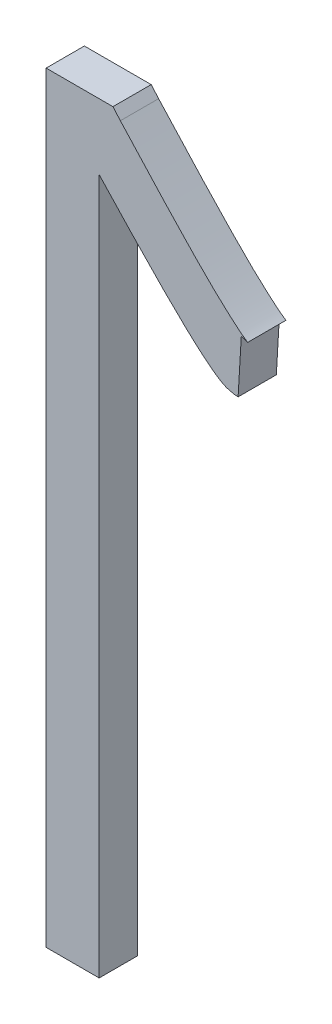
ISO-10303-21;
HEADER;
FILE_DESCRIPTION(('STEP AP214'),'2;1');
FILE_NAME('part.step','',(''),(''),'','','');
FILE_SCHEMA(('AUTOMOTIVE_DESIGN { 1 0 10303 214 1 1 1 1 }'));
ENDSEC;
DATA;
#1=APPLICATION_CONTEXT('core data for automotive mechanical design processes');
#2=APPLICATION_PROTOCOL_DEFINITION('international standard','automotive_design',2000,#1);
#3=PRODUCT_CONTEXT('',#1,'mechanical');
#4=PRODUCT('Part','Part','',(#3));
#5=PRODUCT_RELATED_PRODUCT_CATEGORY('part','',(#4));
#6=PRODUCT_DEFINITION_FORMATION('','',#4);
#7=PRODUCT_DEFINITION_CONTEXT('part definition',#1,'design');
#8=PRODUCT_DEFINITION('design','',#6,#7);
#9=PRODUCT_DEFINITION_SHAPE('','',#8);
#10=(LENGTH_UNIT() NAMED_UNIT(*) SI_UNIT(.MILLI.,.METRE.));
#11=(NAMED_UNIT(*) PLANE_ANGLE_UNIT() SI_UNIT($,.RADIAN.));
#12=(NAMED_UNIT(*) SI_UNIT($,.STERADIAN.) SOLID_ANGLE_UNIT());
#13=UNCERTAINTY_MEASURE_WITH_UNIT(LENGTH_MEASURE(1.E-05),#10,'distance_accuracy_value','');
#14=(GEOMETRIC_REPRESENTATION_CONTEXT(3) GLOBAL_UNCERTAINTY_ASSIGNED_CONTEXT((#13)) GLOBAL_UNIT_ASSIGNED_CONTEXT((#10,
#11,#12)) REPRESENTATION_CONTEXT('',''));
#15=CARTESIAN_POINT('',(0.,0.,0.));
#16=DIRECTION('',(0.,0.,1.));
#17=DIRECTION('',(1.,0.,0.));
#18=AXIS2_PLACEMENT_3D('',#15,#16,#17);
#19=CARTESIAN_POINT('',(68.582238555984,60.4182003094345,-39.1));
#20=DIRECTION('',(0.,0.,-1.));
#21=DIRECTION('',(-1.,0.,0.));
#22=AXIS2_PLACEMENT_3D('',#19,#20,#21);
#23=PLANE('',#22);
#24=DIRECTION('',(0.,1.,0.));
#25=VECTOR('',#24,1.);
#26=CARTESIAN_POINT('',(68.4126530057903,58.7764032970511,-39.1));
#27=LINE('',#26,#25);
#28=CARTESIAN_POINT('',(68.4126530057903,60.5960981652811,-39.1));
#29=VERTEX_POINT('',#28);
#30=CARTESIAN_POINT('',(68.4126530057903,58.7764032970511,-39.1));
#31=VERTEX_POINT('',#30);
#32=EDGE_CURVE('E149',#29,#31,#27,.F.);
#33=ORIENTED_EDGE('',*,*,#32,.T.);
#34=DIRECTION('',(1.,0.,0.));
#35=VECTOR('',#34,1.);
#36=CARTESIAN_POINT('',(68.2739567505903,58.7764032970511,-39.1));
#37=LINE('',#36,#35);
#38=CARTESIAN_POINT('',(68.2739567505903,58.7764032970511,-39.1));
#39=VERTEX_POINT('',#38);
#40=EDGE_CURVE('E137',#31,#39,#37,.F.);
#41=ORIENTED_EDGE('',*,*,#40,.T.);
#42=DIRECTION('',(0.,1.,0.));
#43=VECTOR('',#42,1.);
#44=CARTESIAN_POINT('',(68.2739567505903,60.7680815217311,-39.1));
#45=LINE('',#44,#43);
#46=CARTESIAN_POINT('',(68.2739567505903,60.7680815217311,-39.1));
#47=VERTEX_POINT('',#46);
#48=EDGE_CURVE('E131',#39,#47,#45,.T.);
#49=ORIENTED_EDGE('',*,*,#48,.T.);
#50=DIRECTION('',(1.,0.,0.));
#51=VECTOR('',#50,1.);
#52=CARTESIAN_POINT('',(68.4487140320903,60.7680815217311,-39.1));
#53=LINE('',#52,#51);
#54=CARTESIAN_POINT('',(68.4487140320903,60.7680815217311,-39.1));
#55=VERTEX_POINT('',#54);
#56=EDGE_CURVE('E124',#47,#55,#53,.T.);
#57=ORIENTED_EDGE('',*,*,#56,.T.);
#58=DIRECTION('',(0.658504607868218,-0.75257669470714,0.));
#59=VECTOR('',#58,1.);
#60=CARTESIAN_POINT('',(68.4681315078485,60.7458901208646,-39.1));
#61=LINE('',#60,#59);
#62=CARTESIAN_POINT('',(68.4681315078694,60.7458901208828,-39.1));
#63=VERTEX_POINT('',#62);
#64=EDGE_CURVE('E94',#55,#63,#61,.T.);
#65=ORIENTED_EDGE('',*,*,#64,.T.);
#66=CARTESIAN_POINT('',(68.4681315078903,60.7458901209011,-39.1));
#67=CARTESIAN_POINT('',(68.4736164948075,60.7396214656324,-39.1));
#68=CARTESIAN_POINT('',(68.4791839360921,60.7334274179446,-39.1));
#69=CARTESIAN_POINT('',(68.4903891592348,60.7211030082827,-39.1));
#70=CARTESIAN_POINT('',(68.4960269407174,60.714972645969,-39.1));
#71=CARTESIAN_POINT('',(68.5072782931612,60.7026900600058,-39.1));
#72=CARTESIAN_POINT('',(68.5128918643092,60.6965378365257,-39.1));
#73=CARTESIAN_POINT('',(68.5241183751695,60.6842327006801,-39.1));
#74=CARTESIAN_POINT('',(68.5297313148789,60.6780797883117,-39.1));
#75=CARTESIAN_POINT('',(68.546626563277,60.6596324695833,-39.1));
#76=CARTESIAN_POINT('',(68.5579454041288,60.6473715542867,-39.1));
#77=CARTESIAN_POINT('',(68.5806382834373,60.6229008717802,-39.1));
#78=CARTESIAN_POINT('',(68.5920123217262,60.6106911044149,-39.1));
#79=CARTESIAN_POINT('',(68.6189827231131,60.5819584109174,-39.1));
#80=CARTESIAN_POINT('',(68.6346184371338,60.5654725937526,-39.1));
#81=CARTESIAN_POINT('',(68.6660715168551,60.5327012943414,-39.1));
#82=CARTESIAN_POINT('',(68.6818886954544,60.5164156363187,-39.1));
#83=CARTESIAN_POINT('',(68.706115632421,60.4924084429973,-39.1));
#84=CARTESIAN_POINT('',(68.7142958547699,60.4844569460071,-39.1));
#85=CARTESIAN_POINT('',(68.7308583745617,60.4687713627148,-39.1));
#86=CARTESIAN_POINT('',(68.7392406115286,60.4610372128122,-39.1));
#87=CARTESIAN_POINT('',(68.7520010697041,60.4496245242541,-39.1));
#88=CARTESIAN_POINT('',(68.756290955221,60.4458473362809,-39.1));
#89=CARTESIAN_POINT('',(68.7649256117805,60.4383601636039,-39.1));
#90=CARTESIAN_POINT('',(68.7692703660292,60.4346501591445,-39.1));
#91=CARTESIAN_POINT('',(68.7780327528213,60.4273007912787,-39.1));
#92=CARTESIAN_POINT('',(68.7824504669913,60.423661518531,-39.1));
#93=CARTESIAN_POINT('',(68.7915155842799,60.4166763698502,-39.1));
#94=CARTESIAN_POINT('',(68.7961632164549,60.4133307961092,-39.1));
#95=CARTESIAN_POINT('',(68.8010025203903,60.4102451833211,-39.1));
#96=B_SPLINE_CURVE_WITH_KNOTS('',3,(#66,#67,#68,#69,#70,#71,#72,#73,#74,#75,#76,#77,#78,#79,#80,
#81,#82,#83,#84,#85,#86,#87,#88,#89,#90,#91,#92,#93,#94,#95),.UNSPECIFIED.,.F.,.F.,(4,2,2,2,2,2,
2,2,2,2,2,2,2,2,4),(0.,0.0249855688328893,0.0499710043863174,0.0749562468902316,
0.0999416009353598,0.1500014568658,0.200061160724165,0.26822538348651,0.336324714485996,
0.370545633618882,0.404756432448146,0.421902679750944,0.43904380043895,0.456205608290144,
0.473384872185928),.UNSPECIFIED.);
#97=CARTESIAN_POINT('',(68.8010025203903,60.4102451833211,-39.1));
#98=VERTEX_POINT('',#97);
#99=EDGE_CURVE('E24',#63,#98,#96,.T.);
#100=ORIENTED_EDGE('',*,*,#99,.T.);
#101=DIRECTION('',(-0.948683298050731,0.316227766016185,0.));
#102=VECTOR('',#101,1.);
#103=CARTESIAN_POINT('',(68.7843589697003,60.4157930335511,-39.1));
#104=LINE('',#103,#102);
#105=CARTESIAN_POINT('',(68.7843589696936,60.4157930335311,-39.1));
#106=VERTEX_POINT('',#105);
#107=EDGE_CURVE('E97',#98,#106,#104,.T.);
#108=ORIENTED_EDGE('',*,*,#107,.T.);
#109=DIRECTION('',(-0.0587220219514129,-0.998274373174999,0.));
#110=VECTOR('',#109,1.);
#111=CARTESIAN_POINT('',(68.7760371943786,60.2743228532218,-39.1));
#112=LINE('',#111,#110);
#113=CARTESIAN_POINT('',(68.7760371943815,60.2743228532214,-39.1));
#114=VERTEX_POINT('',#113);
#115=EDGE_CURVE('E158',#106,#114,#112,.T.);
#116=ORIENTED_EDGE('',*,*,#115,.T.);
#117=CARTESIAN_POINT('',(68.7760371943903,60.2743228532211,-39.1));
#118=CARTESIAN_POINT('',(68.7733940645664,60.274319779758,-39.1));
#119=CARTESIAN_POINT('',(68.7707729240659,60.2745405892372,-39.1));
#120=CARTESIAN_POINT('',(68.7655533155897,60.2752571363806,-39.1));
#121=CARTESIAN_POINT('',(68.7629550037397,60.2757541127675,-39.1));
#122=CARTESIAN_POINT('',(68.7578652459366,60.2768297431108,-39.1));
#123=CARTESIAN_POINT('',(68.7553730188563,60.2774053173034,-39.1));
#124=CARTESIAN_POINT('',(68.750433918391,60.2787241094511,-39.1));
#125=CARTESIAN_POINT('',(68.7479869553638,60.2794669462294,-39.1));
#126=CARTESIAN_POINT('',(68.7394311631281,60.2825971907497,-39.1));
#127=CARTESIAN_POINT('',(68.7336056230242,60.285735402586,-39.1));
#128=CARTESIAN_POINT('',(68.7223437549455,60.292699790431,-39.1));
#129=CARTESIAN_POINT('',(68.7169138126133,60.2965347586588,-39.1));
#130=CARTESIAN_POINT('',(68.699065029213,60.3097339810867,-39.1));
#131=CARTESIAN_POINT('',(68.6870272775645,60.319623789331,-39.1));
#132=CARTESIAN_POINT('',(68.6635061967046,60.3400412272072,-39.1));
#133=CARTESIAN_POINT('',(68.6520236705465,60.3505697337943,-39.1));
#134=CARTESIAN_POINT('',(68.6180532691968,60.3824934945652,-39.1));
#135=CARTESIAN_POINT('',(68.5959535589419,60.404302790738,-39.1));
#136=CARTESIAN_POINT('',(68.5603818650129,60.4402707171844,-39.1));
#137=CARTESIAN_POINT('',(68.5467457408683,60.4542714702644,-39.1));
#138=CARTESIAN_POINT('',(68.5196094177993,60.4824118104595,-39.1));
#139=CARTESIAN_POINT('',(68.5061092536972,60.4965514313975,-39.1));
#140=CARTESIAN_POINT('',(68.4792453910376,60.5248943944313,-39.1));
#141=CARTESIAN_POINT('',(68.4658814414905,60.5390974998758,-39.1));
#142=CARTESIAN_POINT('',(68.4392243476964,60.5675618843583,-39.1));
#143=CARTESIAN_POINT('',(68.4259311830003,60.5818231442289,-39.1));
#144=CARTESIAN_POINT('',(68.4126530057903,60.5960981652811,-39.1));
#145=B_SPLINE_CURVE_WITH_KNOTS('',3,(#117,#118,#119,#120,#121,#122,#123,#124,#125,#126,#127,
#128,#129,#130,#131,#132,#133,#134,#135,#136,#137,#138,#139,#140,#141,#142,#143,#144),
.UNSPECIFIED.,.F.,.F.,(4,2,2,2,2,2,2,2,2,2,2,2,2,4),(0.,0.00788918398769791,0.0158140432308874,
0.0234883023156843,0.0311452463325542,0.0508253054848541,0.0707735474808018,0.117442432154255,
0.164176912542595,0.257295522094539,0.315928121278405,0.374575373910319,0.433080860556519,
0.491568412808121),.UNSPECIFIED.);
#146=EDGE_CURVE('E218',#114,#29,#145,.T.);
#147=ORIENTED_EDGE('',*,*,#146,.T.);
#148=EDGE_LOOP('',(#33,#41,#49,#57,#65,#100,#108,#116,#147));
#149=FACE_BOUND('',#148,.T.);
#150=ADVANCED_FACE('F17',(#149),#23,.T.);
#151=CARTESIAN_POINT('',(68.4487140320903,60.7680815217311,-39.));
#152=DIRECTION('',(0.,-1.,0.));
#153=DIRECTION('',(0.,0.,-1.));
#154=AXIS2_PLACEMENT_3D('',#151,#152,#153);
#155=PLANE('',#154);
#156=DIRECTION('',(0.,0.,-1.));
#157=VECTOR('',#156,1.);
#158=CARTESIAN_POINT('',(68.2739567505903,60.7680815217311,-39.));
#159=LINE('',#158,#157);
#160=CARTESIAN_POINT('',(68.2739567505903,60.7680815217311,-39.));
#161=VERTEX_POINT('',#160);
#162=EDGE_CURVE('E134',#47,#161,#159,.F.);
#163=ORIENTED_EDGE('',*,*,#162,.T.);
#164=DIRECTION('',(-1.,0.,0.));
#165=VECTOR('',#164,1.);
#166=CARTESIAN_POINT('',(68.582238555984,60.7680815217311,-39.));
#167=LINE('',#166,#165);
#168=CARTESIAN_POINT('',(68.4487140320903,60.7680815217311,-39.));
#169=VERTEX_POINT('',#168);
#170=EDGE_CURVE('E127',#161,#169,#167,.F.);
#171=ORIENTED_EDGE('',*,*,#170,.T.);
#172=DIRECTION('',(0.,0.,1.));
#173=VECTOR('',#172,1.);
#174=CARTESIAN_POINT('',(68.4487140320903,60.7680815217311,-39.));
#175=LINE('',#174,#173);
#176=EDGE_CURVE('E121',#169,#55,#175,.F.);
#177=ORIENTED_EDGE('',*,*,#176,.T.);
#178=ORIENTED_EDGE('',*,*,#56,.F.);
#179=EDGE_LOOP('',(#163,#171,#177,#178));
#180=FACE_BOUND('',#179,.T.);
#181=ADVANCED_FACE('F208',(#180),#155,.F.);
#182=CARTESIAN_POINT('',(68.4681315078485,60.7458901208646,-39.));
#183=DIRECTION('',(-0.75257669470714,-0.658504607868218,0.));
#184=DIRECTION('',(0.658504607868218,-0.75257669470714,0.));
#185=AXIS2_PLACEMENT_3D('',#182,#183,#184);
#186=PLANE('',#185);
#187=ORIENTED_EDGE('',*,*,#176,.F.);
#188=DIRECTION('',(0.658504609284895,-0.752576693467548,0.));
#189=VECTOR('',#188,1.);
#190=CARTESIAN_POINT('',(68.4487140320903,60.7680815217311,-39.));
#191=LINE('',#190,#189);
#192=CARTESIAN_POINT('',(68.4681315078903,60.7458901209011,-39.));
#193=VERTEX_POINT('',#192);
#194=EDGE_CURVE('E130',#169,#193,#191,.T.);
#195=ORIENTED_EDGE('',*,*,#194,.T.);
#196=DIRECTION('',(0.,0.,-1.));
#197=VECTOR('',#196,1.);
#198=CARTESIAN_POINT('',(68.4681315078903,60.7458901209011,-39.05));
#199=LINE('',#198,#197);
#200=EDGE_CURVE('E103',#193,#63,#199,.T.);
#201=ORIENTED_EDGE('',*,*,#200,.T.);
#202=ORIENTED_EDGE('',*,*,#64,.F.);
#203=EDGE_LOOP('',(#187,#195,#201,#202));
#204=FACE_BOUND('',#203,.T.);
#205=ADVANCED_FACE('F205',(#204),#186,.F.);
#206=CARTESIAN_POINT('',(68.8010025203903,60.4102451833211,-39.));
#207=CARTESIAN_POINT('',(68.8010025203903,60.4102451833211,-39.1));
#208=CARTESIAN_POINT('',(68.7969830708903,60.4128106150711,-39.));
#209=CARTESIAN_POINT('',(68.7969830708903,60.4128106150711,-39.1));
#210=CARTESIAN_POINT('',(68.7872719046903,60.4196598710911,-39.));
#211=CARTESIAN_POINT('',(68.7872719046903,60.4196598710911,-39.1));
#212=CARTESIAN_POINT('',(68.7707615148903,60.4332862315011,-39.));
#213=CARTESIAN_POINT('',(68.7707615148903,60.4332862315011,-39.1));
#214=CARTESIAN_POINT('',(68.7495996360903,60.4515757994111,-39.));
#215=CARTESIAN_POINT('',(68.7495996360903,60.4515757994111,-39.1));
#216=CARTESIAN_POINT('',(68.7248906503903,60.4741962100811,-39.));
#217=CARTESIAN_POINT('',(68.7248906503903,60.4741962100811,-39.1));
#218=CARTESIAN_POINT('',(68.6976399315903,60.5005919824511,-39.));
#219=CARTESIAN_POINT('',(68.6976399315903,60.5005919824511,-39.1));
#220=CARTESIAN_POINT('',(68.6684088003903,60.5302387905511,-39.));
#221=CARTESIAN_POINT('',(68.6684088003903,60.5302387905511,-39.1));
#222=CARTESIAN_POINT('',(68.6373164434903,60.5626383132911,-39.));
#223=CARTESIAN_POINT('',(68.6373164434903,60.5626383132911,-39.1));
#224=CARTESIAN_POINT('',(68.6044849667903,60.5973079919511,-39.));
#225=CARTESIAN_POINT('',(68.6044849667903,60.5973079919511,-39.1));
#226=CARTESIAN_POINT('',(68.5705142045903,60.6337628938011,-39.));
#227=CARTESIAN_POINT('',(68.5705142045903,60.6337628938011,-39.1));
#228=CARTESIAN_POINT('',(68.5360324359903,60.6710978473811,-39.));
#229=CARTESIAN_POINT('',(68.5360324359903,60.6710978473811,-39.1));
#230=CARTESIAN_POINT('',(68.5019219868903,60.7086364377211,-39.));
#231=CARTESIAN_POINT('',(68.5019219868903,60.7086364377211,-39.1));
#232=CARTESIAN_POINT('',(68.4791241484903,60.7333271030511,-39.));
#233=CARTESIAN_POINT('',(68.4791241484903,60.7333271030511,-39.1));
#234=CARTESIAN_POINT('',(68.4681315078903,60.7458901209011,-39.));
#235=CARTESIAN_POINT('',(68.4681315078903,60.7458901209011,-39.1));
#236=B_SPLINE_SURFACE_WITH_KNOTS('',3,1,((#206,#207),(#208,#209),(#210,#211),(#212,#213),(#214,
#215),(#216,#217),(#218,#219),(#220,#221),(#222,#223),(#224,#225),(#226,#227),(#228,#229),(#230,
#231),(#232,#233),(#234,#235)),.UNSPECIFIED.,.F.,.F.,.F.,(4,1,1,1,1,1,1,1,1,1,1,1,4),(2,2),(0.,
0.0301632298913,0.0753104703666,0.1355499087429,0.2074424892077,0.2875616665251,0.3759570962285,
0.4712749173558,0.5721374197463,0.6785504860529,0.7870597152265,0.894208704653,1.),(1.,1.1),.UNSPECIFIED.);
#237=CARTESIAN_POINT('',(68.4681315078903,60.7458901209011,-39.));
#238=CARTESIAN_POINT('',(68.4736164948075,60.7396214656324,-39.));
#239=CARTESIAN_POINT('',(68.4791839360921,60.7334274179447,-39.));
#240=CARTESIAN_POINT('',(68.4903891592348,60.7211030082827,-39.));
#241=CARTESIAN_POINT('',(68.4960269407173,60.7149726459689,-39.));
#242=CARTESIAN_POINT('',(68.5072782931612,60.7026900600058,-39.));
#243=CARTESIAN_POINT('',(68.5128918643092,60.6965378365257,-39.));
#244=CARTESIAN_POINT('',(68.5241183751695,60.6842327006801,-39.));
#245=CARTESIAN_POINT('',(68.5297313148789,60.6780797883117,-39.));
#246=CARTESIAN_POINT('',(68.546626563277,60.6596324695833,-39.));
#247=CARTESIAN_POINT('',(68.5579454041288,60.6473715542867,-39.));
#248=CARTESIAN_POINT('',(68.5806382834373,60.6229008717802,-39.));
#249=CARTESIAN_POINT('',(68.5920123217262,60.6106911044149,-39.));
#250=CARTESIAN_POINT('',(68.6189827231131,60.5819584109174,-39.));
#251=CARTESIAN_POINT('',(68.6346184371338,60.5654725937526,-39.));
#252=CARTESIAN_POINT('',(68.6660715168551,60.5327012943414,-39.));
#253=CARTESIAN_POINT('',(68.6818886954544,60.5164156363187,-39.));
#254=CARTESIAN_POINT('',(68.706115632421,60.4924084429973,-39.));
#255=CARTESIAN_POINT('',(68.7142958547699,60.4844569460071,-39.));
#256=CARTESIAN_POINT('',(68.7308583745616,60.4687713627148,-39.));
#257=CARTESIAN_POINT('',(68.7392406115286,60.4610372128122,-39.));
#258=CARTESIAN_POINT('',(68.7520010697041,60.4496245242541,-39.));
#259=CARTESIAN_POINT('',(68.756290955221,60.4458473362809,-39.));
#260=CARTESIAN_POINT('',(68.7649256117805,60.4383601636039,-39.));
#261=CARTESIAN_POINT('',(68.7692703660292,60.4346501591445,-39.));
#262=CARTESIAN_POINT('',(68.7780327528213,60.4273007912787,-39.));
#263=CARTESIAN_POINT('',(68.7824504669913,60.423661518531,-39.));
#264=CARTESIAN_POINT('',(68.7915155842799,60.4166763698502,-39.));
#265=CARTESIAN_POINT('',(68.7961632164549,60.4133307961092,-39.));
#266=CARTESIAN_POINT('',(68.8010025203903,60.4102451833211,-39.));
#267=B_SPLINE_CURVE_WITH_KNOTS('',3,(#237,#238,#239,#240,#241,#242,#243,#244,#245,#246,#247,
#248,#249,#250,#251,#252,#253,#254,#255,#256,#257,#258,#259,#260,#261,#262,#263,#264,#265,#266),
.UNSPECIFIED.,.F.,.F.,(4,2,2,2,2,2,2,2,2,2,2,2,2,2,4),(0.,0.0249855688328934,0.0499710043862984,
0.0749562468902254,0.0999416009353536,0.15000145686578,0.200061160724136,0.26822538348649,
0.336324714485971,0.370545633618862,0.40475643244813,0.421902679750935,0.439043800438946,
0.456205608290149,0.473384872185929),.UNSPECIFIED.);
#268=CARTESIAN_POINT('',(68.8010025203903,60.4102451833211,-39.));
#269=VERTEX_POINT('',#268);
#270=EDGE_CURVE('E114',#193,#269,#267,.T.);
#271=DIRECTION('',(0.,0.,1.));
#272=VECTOR('',#271,1.);
#273=CARTESIAN_POINT('',(68.8010025203903,60.4102451833211,-39.));
#274=LINE('',#273,#272);
#275=EDGE_CURVE('E102',#269,#98,#274,.F.);
#276=ORIENTED_EDGE('',*,*,#200,.F.);
#277=ORIENTED_EDGE('',*,*,#270,.T.);
#278=ORIENTED_EDGE('',*,*,#275,.T.);
#279=ORIENTED_EDGE('',*,*,#99,.F.);
#280=EDGE_LOOP('',(#276,#277,#278,#279));
#281=FACE_BOUND('',#280,.T.);
#282=ADVANCED_FACE('F112',(#281),#236,.F.);
#283=CARTESIAN_POINT('',(68.7843589697003,60.4157930335511,-39.));
#284=DIRECTION('',(0.316227766016185,0.948683298050731,0.));
#285=DIRECTION('',(-0.948683298050731,0.316227766016185,0.));
#286=AXIS2_PLACEMENT_3D('',#283,#284,#285);
#287=PLANE('',#286);
#288=ORIENTED_EDGE('',*,*,#275,.F.);
#289=DIRECTION('',(-0.948683298620533,0.316227764306779,0.));
#290=VECTOR('',#289,1.);
#291=CARTESIAN_POINT('',(68.8010025203903,60.4102451833211,-39.));
#292=LINE('',#291,#290);
#293=CARTESIAN_POINT('',(68.7843589696903,60.4157930335211,-39.));
#294=VERTEX_POINT('',#293);
#295=EDGE_CURVE('E246',#269,#294,#292,.T.);
#296=ORIENTED_EDGE('',*,*,#295,.T.);
#297=DIRECTION('',(0.,0.,1.));
#298=VECTOR('',#297,1.);
#299=CARTESIAN_POINT('',(68.7843589696903,60.4157930335211,-39.));
#300=LINE('',#299,#298);
#301=EDGE_CURVE('E109',#294,#106,#300,.F.);
#302=ORIENTED_EDGE('',*,*,#301,.T.);
#303=ORIENTED_EDGE('',*,*,#107,.F.);
#304=EDGE_LOOP('',(#288,#296,#302,#303));
#305=FACE_BOUND('',#304,.T.);
#306=ADVANCED_FACE('F106',(#305),#287,.F.);
#307=CARTESIAN_POINT('',(68.7760371943786,60.2743228532218,-39.));
#308=DIRECTION('',(-0.998274373174999,0.0587220219514129,0.));
#309=DIRECTION('',(-0.0587220219514129,-0.998274373174999,0.));
#310=AXIS2_PLACEMENT_3D('',#307,#308,#309);
#311=PLANE('',#310);
#312=ORIENTED_EDGE('',*,*,#301,.F.);
#313=DIRECTION('',(-0.0587220218687141,-0.998274373179864,0.));
#314=VECTOR('',#313,1.);
#315=CARTESIAN_POINT('',(68.7843589696903,60.4157930335211,-39.));
#316=LINE('',#315,#314);
#317=CARTESIAN_POINT('',(68.7760371943903,60.2743228532211,-39.));
#318=VERTEX_POINT('',#317);
#319=EDGE_CURVE('E177',#294,#318,#316,.T.);
#320=ORIENTED_EDGE('',*,*,#319,.T.);
#321=DIRECTION('',(0.,0.,-1.));
#322=VECTOR('',#321,1.);
#323=CARTESIAN_POINT('',(68.7760371943903,60.2743228532211,-39.05));
#324=LINE('',#323,#322);
#325=EDGE_CURVE('E160',#318,#114,#324,.T.);
#326=ORIENTED_EDGE('',*,*,#325,.T.);
#327=ORIENTED_EDGE('',*,*,#115,.F.);
#328=EDGE_LOOP('',(#312,#320,#326,#327));
#329=FACE_BOUND('',#328,.T.);
#330=ADVANCED_FACE('F199',(#329),#311,.F.);
#331=CARTESIAN_POINT('',(68.4126530057903,60.5960981652811,-39.));
#332=CARTESIAN_POINT('',(68.4126530057903,60.5960981652811,-39.1));
#333=CARTESIAN_POINT('',(68.4350287671903,60.5720426034211,-39.));
#334=CARTESIAN_POINT('',(68.4350287671903,60.5720426034211,-39.1));
#335=CARTESIAN_POINT('',(68.4764895400903,60.5276260016811,-39.));
#336=CARTESIAN_POINT('',(68.4764895400903,60.5276260016811,-39.1));
#337=CARTESIAN_POINT('',(68.5342292961903,60.4670069466511,-39.));
#338=CARTESIAN_POINT('',(68.5342292961903,60.4670069466511,-39.1));
#339=CARTESIAN_POINT('',(68.5830313270903,60.4171172222911,-39.));
#340=CARTESIAN_POINT('',(68.5830313270903,60.4171172222911,-39.1));
#341=CARTESIAN_POINT('',(68.6241663041903,60.3766587639711,-39.));
#342=CARTESIAN_POINT('',(68.6241663041903,60.3766587639711,-39.1));
#343=CARTESIAN_POINT('',(68.6587579654903,60.3441801883311,-39.));
#344=CARTESIAN_POINT('',(68.6587579654903,60.3441801883311,-39.1));
#345=CARTESIAN_POINT('',(68.6877275465903,60.3188351487611,-39.));
#346=CARTESIAN_POINT('',(68.6877275465903,60.3188351487611,-39.1));
#347=CARTESIAN_POINT('',(68.7115312473903,60.3001795507911,-39.));
#348=CARTESIAN_POINT('',(68.7115312473903,60.3001795507911,-39.1));
#349=CARTESIAN_POINT('',(68.7303163434903,60.2872310175111,-39.));
#350=CARTESIAN_POINT('',(68.7303163434903,60.2872310175111,-39.1));
#351=CARTESIAN_POINT('',(68.7454648382903,60.2798839447611,-39.));
#352=CARTESIAN_POINT('',(68.7454648382903,60.2798839447611,-39.1));
#353=CARTESIAN_POINT('',(68.7575654497903,60.2768444113011,-39.));
#354=CARTESIAN_POINT('',(68.7575654497903,60.2768444113011,-39.1));
#355=CARTESIAN_POINT('',(68.7672886504903,60.2748433362411,-39.));
#356=CARTESIAN_POINT('',(68.7672886504903,60.2748433362411,-39.1));
#357=CARTESIAN_POINT('',(68.7732902080903,60.2743288738711,-39.));
#358=CARTESIAN_POINT('',(68.7732902080903,60.2743288738711,-39.1));
#359=CARTESIAN_POINT('',(68.7760371943903,60.2743228532211,-39.));
#360=CARTESIAN_POINT('',(68.7760371943903,60.2743228532211,-39.1));
#361=B_SPLINE_SURFACE_WITH_KNOTS('',3,1,((#331,#332),(#333,#334),(#335,#336),(#337,#338),(#339,
#340),(#341,#342),(#343,#344),(#345,#346),(#347,#348),(#349,#350),(#351,#352),(#353,#354),(#355,
#356),(#357,#358),(#359,#360)),.UNSPECIFIED.,.F.,.F.,.F.,(4,1,1,1,1,1,1,1,1,1,1,1,4),(2,2),(0.,
0.2005042297176,0.370797139124,0.5109018519751,0.626399680036,0.722885479643,0.8004481808713,
0.8612129274333,0.90738303319198,0.93950368706772,0.96323219905349,0.98333749397607,1.),(1.,
1.1),.UNSPECIFIED.);
#362=CARTESIAN_POINT('',(68.7760371943903,60.2743228532211,-39.));
#363=CARTESIAN_POINT('',(68.7733940645664,60.274319779758,-39.));
#364=CARTESIAN_POINT('',(68.770772924066,60.2745405892372,-39.));
#365=CARTESIAN_POINT('',(68.7655533155899,60.2752571363806,-39.));
#366=CARTESIAN_POINT('',(68.76295500374,60.2757541127675,-39.));
#367=CARTESIAN_POINT('',(68.757865245937,60.2768297431107,-39.));
#368=CARTESIAN_POINT('',(68.7553730188567,60.2774053173033,-39.));
#369=CARTESIAN_POINT('',(68.7504339183915,60.278724109451,-39.));
#370=CARTESIAN_POINT('',(68.7479869553643,60.2794669462292,-39.));
#371=CARTESIAN_POINT('',(68.7394311631289,60.2825971907494,-39.));
#372=CARTESIAN_POINT('',(68.7336056230252,60.2857354025855,-39.));
#373=CARTESIAN_POINT('',(68.7223437549468,60.2926997904302,-39.));
#374=CARTESIAN_POINT('',(68.7169138126148,60.2965347586577,-39.));
#375=CARTESIAN_POINT('',(68.6990650292154,60.3097339810848,-39.));
#376=CARTESIAN_POINT('',(68.6870272775676,60.3196237893285,-39.));
#377=CARTESIAN_POINT('',(68.663506196709,60.3400412272033,-39.));
#378=CARTESIAN_POINT('',(68.6520236705514,60.3505697337897,-39.));
#379=CARTESIAN_POINT('',(68.6180532692036,60.3824934945586,-39.));
#380=CARTESIAN_POINT('',(68.59595355895,60.40430279073,-39.));
#381=CARTESIAN_POINT('',(68.5603818650214,60.4402707171757,-39.));
#382=CARTESIAN_POINT('',(68.5467457408759,60.4542714702565,-39.));
#383=CARTESIAN_POINT('',(68.5196094178054,60.4824118104532,-39.));
#384=CARTESIAN_POINT('',(68.5061092537024,60.496551431392,-39.));
#385=CARTESIAN_POINT('',(68.4792453910413,60.5248943944273,-39.));
#386=CARTESIAN_POINT('',(68.4658814414934,60.5390974998727,-39.));
#387=CARTESIAN_POINT('',(68.4392243476978,60.5675618843567,-39.));
#388=CARTESIAN_POINT('',(68.4259311830011,60.5818231442281,-39.));
#389=CARTESIAN_POINT('',(68.4126530057903,60.5960981652811,-39.));
#390=B_SPLINE_CURVE_WITH_KNOTS('',3,(#362,#363,#364,#365,#366,#367,#368,#369,#370,#371,#372,
#373,#374,#375,#376,#377,#378,#379,#380,#381,#382,#383,#384,#385,#386,#387,#388,#389),
.UNSPECIFIED.,.F.,.F.,(4,2,2,2,2,2,2,2,2,2,2,2,2,4),(0.,0.00788918398753081,0.0158140432305763,
0.023488302315227,0.0311452463319773,0.0508253054835227,0.0707735474787371,0.117442432149387,
0.164176912534926,0.257295522081349,0.315928121268564,0.374575373903833,0.433080860553277,
0.49156841280812),.UNSPECIFIED.);
#391=CARTESIAN_POINT('',(68.4126530057903,60.5960981652811,-39.));
#392=VERTEX_POINT('',#391);
#393=EDGE_CURVE('E168',#318,#392,#390,.T.);
#394=DIRECTION('',(0.,0.,1.));
#395=VECTOR('',#394,1.);
#396=CARTESIAN_POINT('',(68.4126530057903,60.5960981652811,-39.));
#397=LINE('',#396,#395);
#398=EDGE_CURVE('E152',#392,#29,#397,.F.);
#399=ORIENTED_EDGE('',*,*,#325,.F.);
#400=ORIENTED_EDGE('',*,*,#393,.T.);
#401=ORIENTED_EDGE('',*,*,#398,.T.);
#402=ORIENTED_EDGE('',*,*,#146,.F.);
#403=EDGE_LOOP('',(#399,#400,#401,#402));
#404=FACE_BOUND('',#403,.T.);
#405=ADVANCED_FACE('F19',(#404),#361,.F.);
#406=CARTESIAN_POINT('',(68.4126530057903,58.7764032970511,-39.));
#407=DIRECTION('',(-1.,0.,0.));
#408=DIRECTION('',(0.,0.,1.));
#409=AXIS2_PLACEMENT_3D('',#406,#407,#408);
#410=PLANE('',#409);
#411=ORIENTED_EDGE('',*,*,#398,.F.);
#412=DIRECTION('',(0.,1.,0.));
#413=VECTOR('',#412,1.);
#414=CARTESIAN_POINT('',(68.4126530057903,60.4182003094345,-39.));
#415=LINE('',#414,#413);
#416=CARTESIAN_POINT('',(68.4126530057903,58.7764032970511,-39.));
#417=VERTEX_POINT('',#416);
#418=EDGE_CURVE('E176',#392,#417,#415,.F.);
#419=ORIENTED_EDGE('',*,*,#418,.T.);
#420=DIRECTION('',(0.,0.,1.));
#421=VECTOR('',#420,1.);
#422=CARTESIAN_POINT('',(68.4126530057903,58.7764032970511,-39.));
#423=LINE('',#422,#421);
#424=EDGE_CURVE('E151',#417,#31,#423,.F.);
#425=ORIENTED_EDGE('',*,*,#424,.T.);
#426=ORIENTED_EDGE('',*,*,#32,.F.);
#427=EDGE_LOOP('',(#411,#419,#425,#426));
#428=FACE_BOUND('',#427,.T.);
#429=ADVANCED_FACE('F194',(#428),#410,.F.);
#430=CARTESIAN_POINT('',(68.2739567505903,58.7764032970511,-39.));
#431=DIRECTION('',(0.,1.,0.));
#432=DIRECTION('',(0.,0.,1.));
#433=AXIS2_PLACEMENT_3D('',#430,#431,#432);
#434=PLANE('',#433);
#435=ORIENTED_EDGE('',*,*,#424,.F.);
#436=DIRECTION('',(-1.,0.,0.));
#437=VECTOR('',#436,1.);
#438=CARTESIAN_POINT('',(68.582238555984,58.7764032970511,-39.));
#439=LINE('',#438,#437);
#440=CARTESIAN_POINT('',(68.2739567505903,58.7764032970511,-39.));
#441=VERTEX_POINT('',#440);
#442=EDGE_CURVE('E35',#417,#441,#439,.T.);
#443=ORIENTED_EDGE('',*,*,#442,.T.);
#444=DIRECTION('',(0.,0.,-1.));
#445=VECTOR('',#444,1.);
#446=CARTESIAN_POINT('',(68.2739567505903,58.7764032970511,-39.));
#447=LINE('',#446,#445);
#448=EDGE_CURVE('E43',#441,#39,#447,.T.);
#449=ORIENTED_EDGE('',*,*,#448,.T.);
#450=ORIENTED_EDGE('',*,*,#40,.F.);
#451=EDGE_LOOP('',(#435,#443,#449,#450));
#452=FACE_BOUND('',#451,.T.);
#453=ADVANCED_FACE('F191',(#452),#434,.F.);
#454=CARTESIAN_POINT('',(68.2739567505903,60.7680815217311,-39.));
#455=DIRECTION('',(1.,0.,0.));
#456=DIRECTION('',(0.,0.,-1.));
#457=AXIS2_PLACEMENT_3D('',#454,#455,#456);
#458=PLANE('',#457);
#459=ORIENTED_EDGE('',*,*,#448,.F.);
#460=DIRECTION('',(0.,1.,0.));
#461=VECTOR('',#460,1.);
#462=CARTESIAN_POINT('',(68.2739567505903,60.4182003094345,-39.));
#463=LINE('',#462,#461);
#464=EDGE_CURVE('E11',#441,#161,#463,.T.);
#465=ORIENTED_EDGE('',*,*,#464,.T.);
#466=ORIENTED_EDGE('',*,*,#162,.F.);
#467=ORIENTED_EDGE('',*,*,#48,.F.);
#468=EDGE_LOOP('',(#459,#465,#466,#467));
#469=FACE_BOUND('',#468,.T.);
#470=ADVANCED_FACE('F186',(#469),#458,.F.);
#471=CARTESIAN_POINT('',(68.582238555984,60.4182003094345,-39.));
#472=DIRECTION('',(0.,0.,-1.));
#473=DIRECTION('',(-1.,0.,0.));
#474=AXIS2_PLACEMENT_3D('',#471,#472,#473);
#475=PLANE('',#474);
#476=ORIENTED_EDGE('',*,*,#442,.F.);
#477=ORIENTED_EDGE('',*,*,#418,.F.);
#478=ORIENTED_EDGE('',*,*,#393,.F.);
#479=ORIENTED_EDGE('',*,*,#319,.F.);
#480=ORIENTED_EDGE('',*,*,#295,.F.);
#481=ORIENTED_EDGE('',*,*,#270,.F.);
#482=ORIENTED_EDGE('',*,*,#194,.F.);
#483=ORIENTED_EDGE('',*,*,#170,.F.);
#484=ORIENTED_EDGE('',*,*,#464,.F.);
#485=EDGE_LOOP('',(#476,#477,#478,#479,#480,#481,#482,#483,#484));
#486=FACE_BOUND('',#485,.T.);
#487=ADVANCED_FACE('F182',(#486),#475,.F.);
#488=CLOSED_SHELL('',(#150,#181,#205,#282,#306,#330,#405,#429,#453,#470,#487));
#489=MANIFOLD_SOLID_BREP('B1',#488);
#490=ADVANCED_BREP_SHAPE_REPRESENTATION('',(#18,#489),#14);
#491=SHAPE_DEFINITION_REPRESENTATION(#9,#490);
ENDSEC;
END-ISO-10303-21;
